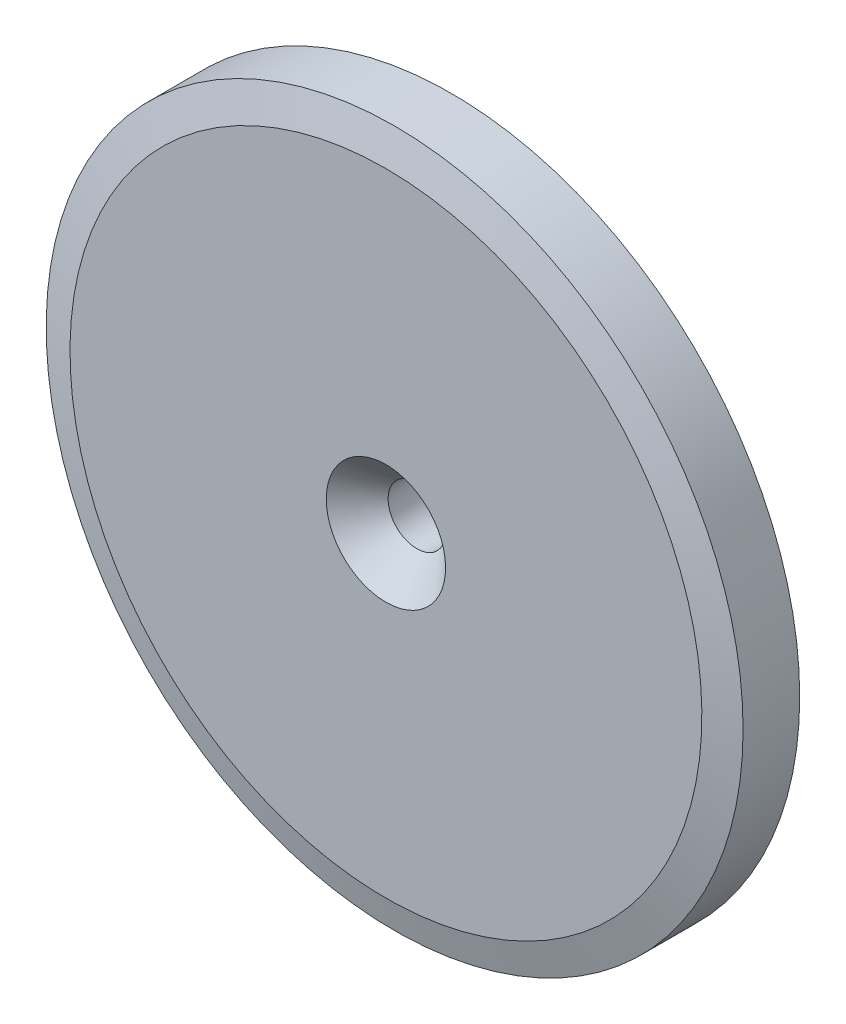
ISO-10303-21;
HEADER;
FILE_DESCRIPTION(('STEP AP214'),'2;1');
FILE_NAME('part.step','',(''),(''),'','','');
FILE_SCHEMA(('AUTOMOTIVE_DESIGN { 1 0 10303 214 1 1 1 1 }'));
ENDSEC;
DATA;
#1=APPLICATION_CONTEXT('core data for automotive mechanical design processes');
#2=APPLICATION_PROTOCOL_DEFINITION('international standard','automotive_design',2000,#1);
#3=PRODUCT_CONTEXT('',#1,'mechanical');
#4=PRODUCT('Part','Part','',(#3));
#5=PRODUCT_RELATED_PRODUCT_CATEGORY('part','',(#4));
#6=PRODUCT_DEFINITION_FORMATION('','',#4);
#7=PRODUCT_DEFINITION_CONTEXT('part definition',#1,'design');
#8=PRODUCT_DEFINITION('design','',#6,#7);
#9=PRODUCT_DEFINITION_SHAPE('','',#8);
#10=(LENGTH_UNIT() NAMED_UNIT(*) SI_UNIT(.MILLI.,.METRE.));
#11=(NAMED_UNIT(*) PLANE_ANGLE_UNIT() SI_UNIT($,.RADIAN.));
#12=(NAMED_UNIT(*) SI_UNIT($,.STERADIAN.) SOLID_ANGLE_UNIT());
#13=UNCERTAINTY_MEASURE_WITH_UNIT(LENGTH_MEASURE(1.E-05),#10,'distance_accuracy_value','');
#14=(GEOMETRIC_REPRESENTATION_CONTEXT(3) GLOBAL_UNCERTAINTY_ASSIGNED_CONTEXT((#13)) GLOBAL_UNIT_ASSIGNED_CONTEXT((#10,
#11,#12)) REPRESENTATION_CONTEXT('',''));
#15=CARTESIAN_POINT('',(0.,0.,0.));
#16=DIRECTION('',(0.,0.,1.));
#17=DIRECTION('',(1.,0.,0.));
#18=AXIS2_PLACEMENT_3D('',#15,#16,#17);
#19=CARTESIAN_POINT('',(0.,0.,7.5));
#20=DIRECTION('',(0.,0.,-1.));
#21=DIRECTION('',(-1.,0.,0.));
#22=AXIS2_PLACEMENT_3D('',#19,#20,#21);
#23=PLANE('',#22);
#24=CARTESIAN_POINT('',(0.,0.,7.50000000005002));
#25=DIRECTION('',(0.,0.,1.));
#26=DIRECTION('',(0.,-1.,0.));
#27=AXIS2_PLACEMENT_3D('',#24,#25,#26);
#28=CIRCLE('',#27,6.84999999998581);
#29=CARTESIAN_POINT('',(0.,-6.84999999998581,7.50000000005002));
#30=VERTEX_POINT('',#29);
#31=EDGE_CURVE('E32',#30,#30,#28,.F.);
#32=ORIENTED_EDGE('',*,*,#31,.T.);
#33=EDGE_LOOP('',(#32));
#34=FACE_BOUND('',#33,.T.);
#35=CARTESIAN_POINT('',(0.,0.,7.49999999999528));
#36=DIRECTION('',(0.,0.,-1.));
#37=DIRECTION('',(0.,1.,0.));
#38=AXIS2_PLACEMENT_3D('',#35,#36,#37);
#39=CIRCLE('',#38,36.2679491924014);
#40=CARTESIAN_POINT('',(0.,36.2679491924014,7.49999999999528));
#41=VERTEX_POINT('',#40);
#42=EDGE_CURVE('E18',#41,#41,#39,.T.);
#43=ORIENTED_EDGE('',*,*,#42,.F.);
#44=EDGE_LOOP('',(#43));
#45=FACE_BOUND('',#44,.T.);
#46=ADVANCED_FACE('F15',(#34,#45),#23,.F.);
#47=CARTESIAN_POINT('',(0.,0.,6.50000000000472));
#48=DIRECTION('',(0.,0.,-1.));
#49=DIRECTION('',(0.,1.,0.));
#50=AXIS2_PLACEMENT_3D('',#47,#48,#49);
#51=CONICAL_SURFACE('',#50,39.9999999999986,1.308996939);
#52=CARTESIAN_POINT('',(0.,0.,6.50000000001));
#53=DIRECTION('',(0.,0.,1.));
#54=DIRECTION('',(1.,0.,0.));
#55=AXIS2_PLACEMENT_3D('',#52,#53,#54);
#56=CIRCLE('',#55,40.);
#57=CARTESIAN_POINT('',(40.,0.,6.50000000001));
#58=VERTEX_POINT('',#57);
#59=EDGE_CURVE('E30',#58,#58,#56,.F.);
#60=ORIENTED_EDGE('',*,*,#59,.F.);
#61=EDGE_LOOP('',(#60));
#62=FACE_BOUND('',#61,.T.);
#63=ORIENTED_EDGE('',*,*,#42,.T.);
#64=EDGE_LOOP('',(#63));
#65=FACE_BOUND('',#64,.T.);
#66=ADVANCED_FACE('F40',(#62,#65),#51,.T.);
#67=CARTESIAN_POINT('',(0.,0.,7.50000000005002));
#68=DIRECTION('',(0.,0.,1.));
#69=DIRECTION('',(0.,-1.,0.));
#70=AXIS2_PLACEMENT_3D('',#67,#68,#69);
#71=CONICAL_SURFACE('',#70,6.84999999998581,0.785398163389442);
#72=CARTESIAN_POINT('',(0.,0.,3.95));
#73=DIRECTION('',(0.,0.,1.));
#74=DIRECTION('',(1.,0.,0.));
#75=AXIS2_PLACEMENT_3D('',#72,#73,#74);
#76=CIRCLE('',#75,3.3);
#77=CARTESIAN_POINT('',(3.3,0.,3.95));
#78=VERTEX_POINT('',#77);
#79=EDGE_CURVE('E27',#78,#78,#76,.F.);
#80=ORIENTED_EDGE('',*,*,#79,.T.);
#81=EDGE_LOOP('',(#80));
#82=FACE_BOUND('',#81,.T.);
#83=ORIENTED_EDGE('',*,*,#31,.F.);
#84=EDGE_LOOP('',(#83));
#85=FACE_BOUND('',#84,.T.);
#86=ADVANCED_FACE('F47',(#82,#85),#71,.F.);
#87=CARTESIAN_POINT('',(0.,0.,0.));
#88=DIRECTION('',(0.,0.,1.));
#89=DIRECTION('',(1.,0.,0.));
#90=AXIS2_PLACEMENT_3D('',#87,#88,#89);
#91=CYLINDRICAL_SURFACE('',#90,40.);
#92=ORIENTED_EDGE('',*,*,#59,.T.);
#93=EDGE_LOOP('',(#92));
#94=FACE_BOUND('',#93,.T.);
#95=CARTESIAN_POINT('',(0.,0.,0.));
#96=DIRECTION('',(0.,0.,1.));
#97=DIRECTION('',(1.,0.,0.));
#98=AXIS2_PLACEMENT_3D('',#95,#96,#97);
#99=CIRCLE('',#98,40.);
#100=CARTESIAN_POINT('',(40.,0.,0.));
#101=VERTEX_POINT('',#100);
#102=EDGE_CURVE('E22',#101,#101,#99,.F.);
#103=ORIENTED_EDGE('',*,*,#102,.F.);
#104=EDGE_LOOP('',(#103));
#105=FACE_BOUND('',#104,.T.);
#106=ADVANCED_FACE('F56',(#94,#105),#91,.T.);
#107=CARTESIAN_POINT('',(0.,0.,-105.885404704));
#108=DIRECTION('',(0.,0.,1.));
#109=DIRECTION('',(1.,0.,0.));
#110=AXIS2_PLACEMENT_3D('',#107,#108,#109);
#111=CYLINDRICAL_SURFACE('',#110,3.3);
#112=ORIENTED_EDGE('',*,*,#79,.F.);
#113=EDGE_LOOP('',(#112));
#114=FACE_BOUND('',#113,.T.);
#115=CARTESIAN_POINT('',(0.,0.,-3.47374906617404E-10));
#116=DIRECTION('',(0.,0.,1.));
#117=DIRECTION('',(1.,0.,0.));
#118=AXIS2_PLACEMENT_3D('',#115,#116,#117);
#119=CIRCLE('',#118,3.3);
#120=CARTESIAN_POINT('',(3.3,0.,-3.47374906617404E-10));
#121=VERTEX_POINT('',#120);
#122=EDGE_CURVE('E10',#121,#121,#119,.T.);
#123=ORIENTED_EDGE('',*,*,#122,.F.);
#124=EDGE_LOOP('',(#123));
#125=FACE_BOUND('',#124,.T.);
#126=ADVANCED_FACE('F51',(#114,#125),#111,.F.);
#127=CARTESIAN_POINT('',(0.,0.,0.));
#128=DIRECTION('',(0.,0.,-1.));
#129=DIRECTION('',(-1.,0.,0.));
#130=AXIS2_PLACEMENT_3D('',#127,#128,#129);
#131=PLANE('',#130);
#132=ORIENTED_EDGE('',*,*,#122,.T.);
#133=EDGE_LOOP('',(#132));
#134=FACE_BOUND('',#133,.T.);
#135=ORIENTED_EDGE('',*,*,#102,.T.);
#136=EDGE_LOOP('',(#135));
#137=FACE_BOUND('',#136,.T.);
#138=ADVANCED_FACE('F49',(#134,#137),#131,.T.);
#139=CLOSED_SHELL('',(#46,#66,#86,#106,#126,#138));
#140=MANIFOLD_SOLID_BREP('B1',#139);
#141=ADVANCED_BREP_SHAPE_REPRESENTATION('',(#18,#140),#14);
#142=SHAPE_DEFINITION_REPRESENTATION(#9,#141);
ENDSEC;
END-ISO-10303-21;
